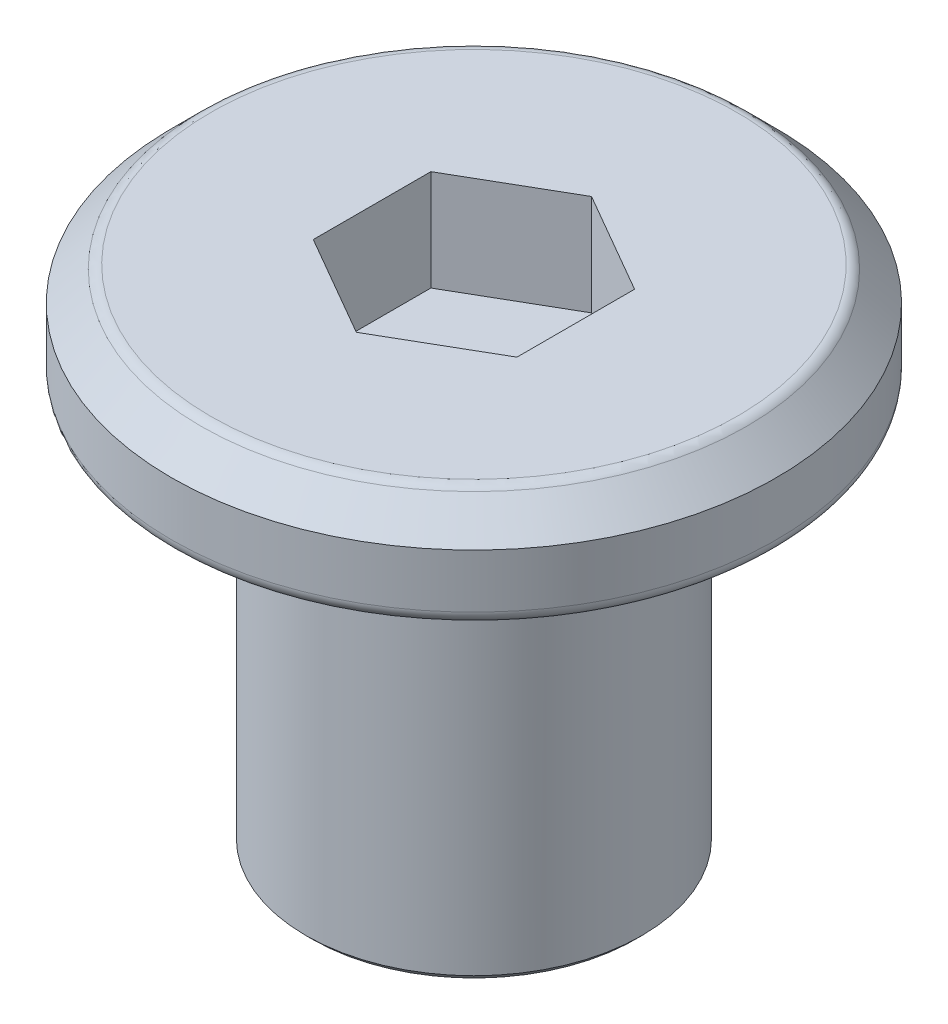
ISO-10303-21;
HEADER;
FILE_DESCRIPTION(('STEP AP214'),'2;1');
FILE_NAME('part.step','',(''),(''),'','','');
FILE_SCHEMA(('AUTOMOTIVE_DESIGN { 1 0 10303 214 1 1 1 1 }'));
ENDSEC;
DATA;
#1=APPLICATION_CONTEXT('core data for automotive mechanical design processes');
#2=APPLICATION_PROTOCOL_DEFINITION('international standard','automotive_design',2000,#1);
#3=PRODUCT_CONTEXT('',#1,'mechanical');
#4=PRODUCT('Part','Part','',(#3));
#5=PRODUCT_RELATED_PRODUCT_CATEGORY('part','',(#4));
#6=PRODUCT_DEFINITION_FORMATION('','',#4);
#7=PRODUCT_DEFINITION_CONTEXT('part definition',#1,'design');
#8=PRODUCT_DEFINITION('design','',#6,#7);
#9=PRODUCT_DEFINITION_SHAPE('','',#8);
#10=(LENGTH_UNIT() NAMED_UNIT(*) SI_UNIT(.MILLI.,.METRE.));
#11=(NAMED_UNIT(*) PLANE_ANGLE_UNIT() SI_UNIT($,.RADIAN.));
#12=(NAMED_UNIT(*) SI_UNIT($,.STERADIAN.) SOLID_ANGLE_UNIT());
#13=UNCERTAINTY_MEASURE_WITH_UNIT(LENGTH_MEASURE(1.E-05),#10,'distance_accuracy_value','');
#14=(GEOMETRIC_REPRESENTATION_CONTEXT(3) GLOBAL_UNCERTAINTY_ASSIGNED_CONTEXT((#13)) GLOBAL_UNIT_ASSIGNED_CONTEXT((#10,
#11,#12)) REPRESENTATION_CONTEXT('',''));
#15=CARTESIAN_POINT('',(0.,0.,0.));
#16=DIRECTION('',(0.,0.,1.));
#17=DIRECTION('',(1.,0.,0.));
#18=AXIS2_PLACEMENT_3D('',#15,#16,#17);
#19=CARTESIAN_POINT('',(0.,1.5,0.));
#20=DIRECTION('',(0.,-1.,0.));
#21=DIRECTION('',(0.,0.,-1.));
#22=AXIS2_PLACEMENT_3D('',#19,#20,#21);
#23=CYLINDRICAL_SURFACE('',#22,4.5);
#24=CARTESIAN_POINT('',(0.,0.2,0.));
#25=DIRECTION('',(0.,1.,0.));
#26=DIRECTION('',(0.,0.,1.));
#27=AXIS2_PLACEMENT_3D('',#24,#25,#26);
#28=CIRCLE('',#27,4.5);
#29=CARTESIAN_POINT('',(0.,0.2,4.5));
#30=VERTEX_POINT('',#29);
#31=EDGE_CURVE('E131',#30,#30,#28,.T.);
#32=ORIENTED_EDGE('',*,*,#31,.T.);
#33=EDGE_LOOP('',(#32));
#34=FACE_BOUND('',#33,.T.);
#35=CARTESIAN_POINT('',(0.,0.999999999999997,0.));
#36=DIRECTION('',(0.,1.,0.));
#37=DIRECTION('',(0.,0.,1.));
#38=AXIS2_PLACEMENT_3D('',#35,#36,#37);
#39=CIRCLE('',#38,4.5);
#40=CARTESIAN_POINT('',(0.,0.999999999999997,4.5));
#41=VERTEX_POINT('',#40);
#42=EDGE_CURVE('E117',#41,#41,#39,.F.);
#43=ORIENTED_EDGE('',*,*,#42,.T.);
#44=EDGE_LOOP('',(#43));
#45=FACE_BOUND('',#44,.T.);
#46=ADVANCED_FACE('F16',(#34,#45),#23,.T.);
#47=CARTESIAN_POINT('',(0.,1.5,0.));
#48=DIRECTION('',(0.,1.,0.));
#49=DIRECTION('',(0.,0.,1.));
#50=AXIS2_PLACEMENT_3D('',#47,#48,#49);
#51=PLANE('',#50);
#52=CARTESIAN_POINT('',(0.,1.5,0.));
#53=DIRECTION('',(0.,1.,0.));
#54=DIRECTION('',(0.,0.,1.));
#55=AXIS2_PLACEMENT_3D('',#52,#53,#54);
#56=CIRCLE('',#55,3.91715728752538);
#57=CARTESIAN_POINT('',(0.,1.5,3.91715728752538));
#58=VERTEX_POINT('',#57);
#59=EDGE_CURVE('E125',#58,#58,#56,.T.);
#60=ORIENTED_EDGE('',*,*,#59,.T.);
#61=EDGE_LOOP('',(#60));
#62=FACE_BOUND('',#61,.T.);
#63=DIRECTION('',(-0.866025403784438,0.,-0.5));
#64=VECTOR('',#63,1.);
#65=CARTESIAN_POINT('',(1.51554445662277,1.5,-0.875));
#66=LINE('',#65,#64);
#67=CARTESIAN_POINT('',(1.51554445662277,1.5,-0.875));
#68=VERTEX_POINT('',#67);
#69=CARTESIAN_POINT('',(0.,1.5,-1.75));
#70=VERTEX_POINT('',#69);
#71=EDGE_CURVE('E32',#68,#70,#66,.T.);
#72=ORIENTED_EDGE('',*,*,#71,.F.);
#73=DIRECTION('',(0.,0.,-1.));
#74=VECTOR('',#73,1.);
#75=CARTESIAN_POINT('',(1.51554445662277,1.5,0.875000000000001));
#76=LINE('',#75,#74);
#77=CARTESIAN_POINT('',(1.51554445662277,1.5,0.875000000000001));
#78=VERTEX_POINT('',#77);
#79=EDGE_CURVE('E113',#78,#68,#76,.T.);
#80=ORIENTED_EDGE('',*,*,#79,.F.);
#81=DIRECTION('',(0.866025403784439,0.,-0.5));
#82=VECTOR('',#81,1.);
#83=CARTESIAN_POINT('',(0.,1.5,1.75));
#84=LINE('',#83,#82);
#85=CARTESIAN_POINT('',(0.,1.5,1.75));
#86=VERTEX_POINT('',#85);
#87=EDGE_CURVE('E111',#86,#78,#84,.T.);
#88=ORIENTED_EDGE('',*,*,#87,.F.);
#89=DIRECTION('',(0.866025403784438,0.,0.5));
#90=VECTOR('',#89,1.);
#91=CARTESIAN_POINT('',(-1.51554445662277,1.5,0.874999999999999));
#92=LINE('',#91,#90);
#93=CARTESIAN_POINT('',(-1.51554445662277,1.5,0.874999999999999));
#94=VERTEX_POINT('',#93);
#95=EDGE_CURVE('E79',#94,#86,#92,.T.);
#96=ORIENTED_EDGE('',*,*,#95,.F.);
#97=DIRECTION('',(0.,0.,1.));
#98=VECTOR('',#97,1.);
#99=CARTESIAN_POINT('',(-1.51554445662277,1.5,-0.875));
#100=LINE('',#99,#98);
#101=CARTESIAN_POINT('',(-1.51554445662277,1.5,-0.875));
#102=VERTEX_POINT('',#101);
#103=EDGE_CURVE('E107',#102,#94,#100,.T.);
#104=ORIENTED_EDGE('',*,*,#103,.F.);
#105=DIRECTION('',(-0.866025403784439,0.,0.5));
#106=VECTOR('',#105,1.);
#107=CARTESIAN_POINT('',(0.,1.5,-1.75));
#108=LINE('',#107,#106);
#109=EDGE_CURVE('E104',#70,#102,#108,.T.);
#110=ORIENTED_EDGE('',*,*,#109,.F.);
#111=EDGE_LOOP('',(#72,#80,#88,#96,#104,#110));
#112=FACE_BOUND('',#111,.T.);
#113=ADVANCED_FACE('F158',(#62,#112),#51,.T.);
#114=CARTESIAN_POINT('',(0.,0.,0.));
#115=DIRECTION('',(0.,1.,0.));
#116=DIRECTION('',(0.,0.,1.));
#117=AXIS2_PLACEMENT_3D('',#114,#115,#116);
#118=PLANE('',#117);
#119=CARTESIAN_POINT('',(0.,0.,0.));
#120=DIRECTION('',(0.,1.,0.));
#121=DIRECTION('',(0.,0.,1.));
#122=AXIS2_PLACEMENT_3D('',#119,#120,#121);
#123=CIRCLE('',#122,2.75);
#124=CARTESIAN_POINT('',(0.,0.,2.75));
#125=VERTEX_POINT('',#124);
#126=EDGE_CURVE('E140',#125,#125,#123,.T.);
#127=ORIENTED_EDGE('',*,*,#126,.T.);
#128=EDGE_LOOP('',(#127));
#129=FACE_BOUND('',#128,.T.);
#130=CARTESIAN_POINT('',(0.,0.,0.));
#131=DIRECTION('',(0.,1.,0.));
#132=DIRECTION('',(0.,0.,1.));
#133=AXIS2_PLACEMENT_3D('',#130,#131,#132);
#134=CIRCLE('',#133,4.3);
#135=CARTESIAN_POINT('',(0.,0.,4.3));
#136=VERTEX_POINT('',#135);
#137=EDGE_CURVE('E134',#136,#136,#134,.F.);
#138=ORIENTED_EDGE('',*,*,#137,.T.);
#139=EDGE_LOOP('',(#138));
#140=FACE_BOUND('',#139,.T.);
#141=ADVANCED_FACE('F164',(#129,#140),#118,.F.);
#142=CARTESIAN_POINT('',(0.,1.5,0.));
#143=DIRECTION('',(0.,-1.,0.));
#144=DIRECTION('',(0.,0.,-1.));
#145=AXIS2_PLACEMENT_3D('',#142,#143,#144);
#146=CONICAL_SURFACE('',#145,4.,0.785398163397447);
#147=CARTESIAN_POINT('',(0.,1.44142135623731,0.));
#148=DIRECTION('',(0.,1.,0.));
#149=DIRECTION('',(0.,0.,1.));
#150=AXIS2_PLACEMENT_3D('',#147,#148,#149);
#151=CIRCLE('',#150,4.05857864376269);
#152=CARTESIAN_POINT('',(0.,1.44142135623731,4.05857864376269));
#153=VERTEX_POINT('',#152);
#154=EDGE_CURVE('E128',#153,#153,#151,.F.);
#155=ORIENTED_EDGE('',*,*,#154,.T.);
#156=EDGE_LOOP('',(#155));
#157=FACE_BOUND('',#156,.T.);
#158=ORIENTED_EDGE('',*,*,#42,.F.);
#159=EDGE_LOOP('',(#158));
#160=FACE_BOUND('',#159,.T.);
#161=ADVANCED_FACE('F170',(#157,#160),#146,.T.);
#162=CARTESIAN_POINT('',(1.51554445662277,0.,-0.875));
#163=DIRECTION('',(0.5,0.,-0.866025403784439));
#164=DIRECTION('',(-0.866025403784439,0.,-0.5));
#165=AXIS2_PLACEMENT_3D('',#162,#163,#164);
#166=PLANE('',#165);
#167=ORIENTED_EDGE('',*,*,#71,.T.);
#168=DIRECTION('',(0.,1.,0.));
#169=VECTOR('',#168,1.);
#170=CARTESIAN_POINT('',(0.,0.,-1.75));
#171=LINE('',#170,#169);
#172=CARTESIAN_POINT('',(0.,0.,-1.75));
#173=VERTEX_POINT('',#172);
#174=EDGE_CURVE('E63',#173,#70,#171,.T.);
#175=ORIENTED_EDGE('',*,*,#174,.F.);
#176=DIRECTION('',(-0.866025403784438,0.,-0.5));
#177=VECTOR('',#176,1.);
#178=CARTESIAN_POINT('',(1.51554445662277,0.,-0.875));
#179=LINE('',#178,#177);
#180=CARTESIAN_POINT('',(1.51554445662277,0.,-0.875));
#181=VERTEX_POINT('',#180);
#182=EDGE_CURVE('E115',#181,#173,#179,.T.);
#183=ORIENTED_EDGE('',*,*,#182,.F.);
#184=DIRECTION('',(0.,1.,0.));
#185=VECTOR('',#184,1.);
#186=CARTESIAN_POINT('',(1.51554445662277,0.,-0.875));
#187=LINE('',#186,#185);
#188=EDGE_CURVE('E40',#181,#68,#187,.T.);
#189=ORIENTED_EDGE('',*,*,#188,.T.);
#190=EDGE_LOOP('',(#167,#175,#183,#189));
#191=FACE_BOUND('',#190,.T.);
#192=ADVANCED_FACE('F173',(#191),#166,.F.);
#193=CARTESIAN_POINT('',(1.51554445662277,0.,0.875000000000001));
#194=DIRECTION('',(1.,0.,0.));
#195=DIRECTION('',(0.,0.,-1.));
#196=AXIS2_PLACEMENT_3D('',#193,#194,#195);
#197=PLANE('',#196);
#198=ORIENTED_EDGE('',*,*,#79,.T.);
#199=ORIENTED_EDGE('',*,*,#188,.F.);
#200=DIRECTION('',(0.,0.,-1.));
#201=VECTOR('',#200,1.);
#202=CARTESIAN_POINT('',(1.51554445662277,0.,0.875000000000001));
#203=LINE('',#202,#201);
#204=CARTESIAN_POINT('',(1.51554445662277,0.,0.875000000000001));
#205=VERTEX_POINT('',#204);
#206=EDGE_CURVE('E91',#205,#181,#203,.T.);
#207=ORIENTED_EDGE('',*,*,#206,.F.);
#208=DIRECTION('',(0.,1.,0.));
#209=VECTOR('',#208,1.);
#210=CARTESIAN_POINT('',(1.51554445662277,0.,0.875000000000001));
#211=LINE('',#210,#209);
#212=EDGE_CURVE('E83',#205,#78,#211,.T.);
#213=ORIENTED_EDGE('',*,*,#212,.T.);
#214=EDGE_LOOP('',(#198,#199,#207,#213));
#215=FACE_BOUND('',#214,.T.);
#216=ADVANCED_FACE('F207',(#215),#197,.F.);
#217=CARTESIAN_POINT('',(0.,0.,1.75));
#218=DIRECTION('',(0.5,0.,0.866025403784439));
#219=DIRECTION('',(0.866025403784439,0.,-0.5));
#220=AXIS2_PLACEMENT_3D('',#217,#218,#219);
#221=PLANE('',#220);
#222=ORIENTED_EDGE('',*,*,#87,.T.);
#223=ORIENTED_EDGE('',*,*,#212,.F.);
#224=DIRECTION('',(0.866025403784439,0.,-0.5));
#225=VECTOR('',#224,1.);
#226=CARTESIAN_POINT('',(0.,0.,1.75));
#227=LINE('',#226,#225);
#228=CARTESIAN_POINT('',(0.,0.,1.75));
#229=VERTEX_POINT('',#228);
#230=EDGE_CURVE('E87',#229,#205,#227,.T.);
#231=ORIENTED_EDGE('',*,*,#230,.F.);
#232=DIRECTION('',(0.,1.,0.));
#233=VECTOR('',#232,1.);
#234=CARTESIAN_POINT('',(0.,0.,1.75));
#235=LINE('',#234,#233);
#236=EDGE_CURVE('E72',#229,#86,#235,.T.);
#237=ORIENTED_EDGE('',*,*,#236,.T.);
#238=EDGE_LOOP('',(#222,#223,#231,#237));
#239=FACE_BOUND('',#238,.T.);
#240=ADVANCED_FACE('F88',(#239),#221,.F.);
#241=CARTESIAN_POINT('',(-1.51554445662277,0.,0.874999999999999));
#242=DIRECTION('',(-0.5,0.,0.866025403784438));
#243=DIRECTION('',(0.866025403784439,0.,0.5));
#244=AXIS2_PLACEMENT_3D('',#241,#242,#243);
#245=PLANE('',#244);
#246=ORIENTED_EDGE('',*,*,#95,.T.);
#247=ORIENTED_EDGE('',*,*,#236,.F.);
#248=DIRECTION('',(0.866025403784438,0.,0.5));
#249=VECTOR('',#248,1.);
#250=CARTESIAN_POINT('',(-1.51554445662277,0.,0.874999999999999));
#251=LINE('',#250,#249);
#252=CARTESIAN_POINT('',(-1.51554445662277,0.,0.874999999999999));
#253=VERTEX_POINT('',#252);
#254=EDGE_CURVE('E76',#253,#229,#251,.T.);
#255=ORIENTED_EDGE('',*,*,#254,.F.);
#256=DIRECTION('',(0.,1.,0.));
#257=VECTOR('',#256,1.);
#258=CARTESIAN_POINT('',(-1.51554445662277,0.,0.874999999999999));
#259=LINE('',#258,#257);
#260=EDGE_CURVE('E84',#253,#94,#259,.T.);
#261=ORIENTED_EDGE('',*,*,#260,.T.);
#262=EDGE_LOOP('',(#246,#247,#255,#261));
#263=FACE_BOUND('',#262,.T.);
#264=ADVANCED_FACE('F74',(#263),#245,.F.);
#265=CARTESIAN_POINT('',(-1.51554445662277,0.,-0.875));
#266=DIRECTION('',(-1.,0.,0.));
#267=DIRECTION('',(0.,0.,1.));
#268=AXIS2_PLACEMENT_3D('',#265,#266,#267);
#269=PLANE('',#268);
#270=ORIENTED_EDGE('',*,*,#103,.T.);
#271=ORIENTED_EDGE('',*,*,#260,.F.);
#272=DIRECTION('',(0.,0.,1.));
#273=VECTOR('',#272,1.);
#274=CARTESIAN_POINT('',(-1.51554445662277,0.,-0.875));
#275=LINE('',#274,#273);
#276=CARTESIAN_POINT('',(-1.51554445662277,0.,-0.875000000000001));
#277=VERTEX_POINT('',#276);
#278=EDGE_CURVE('E96',#277,#253,#275,.T.);
#279=ORIENTED_EDGE('',*,*,#278,.F.);
#280=DIRECTION('',(0.,1.,0.));
#281=VECTOR('',#280,1.);
#282=CARTESIAN_POINT('',(-1.51554445662277,0.,-0.875));
#283=LINE('',#282,#281);
#284=EDGE_CURVE('E120',#277,#102,#283,.T.);
#285=ORIENTED_EDGE('',*,*,#284,.T.);
#286=EDGE_LOOP('',(#270,#271,#279,#285));
#287=FACE_BOUND('',#286,.T.);
#288=ADVANCED_FACE('F214',(#287),#269,.F.);
#289=CARTESIAN_POINT('',(0.,0.,-1.75));
#290=DIRECTION('',(-0.5,0.,-0.866025403784439));
#291=DIRECTION('',(-0.866025403784439,0.,0.5));
#292=AXIS2_PLACEMENT_3D('',#289,#290,#291);
#293=PLANE('',#292);
#294=ORIENTED_EDGE('',*,*,#109,.T.);
#295=ORIENTED_EDGE('',*,*,#284,.F.);
#296=DIRECTION('',(-0.866025403784439,0.,0.5));
#297=VECTOR('',#296,1.);
#298=CARTESIAN_POINT('',(0.,0.,-1.75));
#299=LINE('',#298,#297);
#300=EDGE_CURVE('E98',#173,#277,#299,.T.);
#301=ORIENTED_EDGE('',*,*,#300,.F.);
#302=ORIENTED_EDGE('',*,*,#174,.T.);
#303=EDGE_LOOP('',(#294,#295,#301,#302));
#304=FACE_BOUND('',#303,.T.);
#305=ADVANCED_FACE('F204',(#304),#293,.F.);
#306=CARTESIAN_POINT('',(0.,0.,0.));
#307=DIRECTION('',(0.,-1.,0.));
#308=DIRECTION('',(0.,0.,-1.));
#309=AXIS2_PLACEMENT_3D('',#306,#307,#308);
#310=PLANE('',#309);
#311=ORIENTED_EDGE('',*,*,#206,.T.);
#312=ORIENTED_EDGE('',*,*,#182,.T.);
#313=ORIENTED_EDGE('',*,*,#300,.T.);
#314=ORIENTED_EDGE('',*,*,#278,.T.);
#315=ORIENTED_EDGE('',*,*,#254,.T.);
#316=ORIENTED_EDGE('',*,*,#230,.T.);
#317=EDGE_LOOP('',(#311,#312,#313,#314,#315,#316));
#318=FACE_BOUND('',#317,.T.);
#319=ADVANCED_FACE('F93',(#318),#310,.F.);
#320=CARTESIAN_POINT('',(0.,-6.,0.));
#321=DIRECTION('',(0.,1.,0.));
#322=DIRECTION('',(0.,0.,1.));
#323=AXIS2_PLACEMENT_3D('',#320,#321,#322);
#324=CYLINDRICAL_SURFACE('',#323,2.5);
#325=CARTESIAN_POINT('',(0.,-5.9,0.));
#326=DIRECTION('',(0.,-1.,0.));
#327=DIRECTION('',(0.,0.,-1.));
#328=AXIS2_PLACEMENT_3D('',#325,#326,#327);
#329=CIRCLE('',#328,2.5);
#330=CARTESIAN_POINT('',(0.,-5.9,-2.5));
#331=VERTEX_POINT('',#330);
#332=EDGE_CURVE('E10',#331,#331,#329,.F.);
#333=ORIENTED_EDGE('',*,*,#332,.T.);
#334=EDGE_LOOP('',(#333));
#335=FACE_BOUND('',#334,.T.);
#336=CARTESIAN_POINT('',(0.,-0.25,0.));
#337=DIRECTION('',(0.,1.,0.));
#338=DIRECTION('',(0.,0.,1.));
#339=AXIS2_PLACEMENT_3D('',#336,#337,#338);
#340=CIRCLE('',#339,2.5);
#341=CARTESIAN_POINT('',(0.,-0.25,2.5));
#342=VERTEX_POINT('',#341);
#343=EDGE_CURVE('E137',#342,#342,#340,.F.);
#344=ORIENTED_EDGE('',*,*,#343,.T.);
#345=EDGE_LOOP('',(#344));
#346=FACE_BOUND('',#345,.T.);
#347=ADVANCED_FACE('F195',(#335,#346),#324,.T.);
#348=CARTESIAN_POINT('',(0.,-6.,0.));
#349=DIRECTION('',(0.,-1.,0.));
#350=DIRECTION('',(0.,0.,-1.));
#351=AXIS2_PLACEMENT_3D('',#348,#349,#350);
#352=PLANE('',#351);
#353=CARTESIAN_POINT('',(0.,-6.,0.));
#354=DIRECTION('',(0.,-1.,0.));
#355=DIRECTION('',(0.,0.,-1.));
#356=AXIS2_PLACEMENT_3D('',#353,#354,#355);
#357=CIRCLE('',#356,2.4);
#358=CARTESIAN_POINT('',(0.,-6.,-2.4));
#359=VERTEX_POINT('',#358);
#360=EDGE_CURVE('E25',#359,#359,#357,.T.);
#361=ORIENTED_EDGE('',*,*,#360,.T.);
#362=EDGE_LOOP('',(#361));
#363=FACE_BOUND('',#362,.T.);
#364=ADVANCED_FACE('F145',(#363),#352,.T.);
#365=CARTESIAN_POINT('',(0.,1.3,0.));
#366=DIRECTION('',(0.,1.,0.));
#367=DIRECTION('',(0.,0.,1.));
#368=AXIS2_PLACEMENT_3D('',#365,#366,#367);
#369=TOROIDAL_SURFACE('',#368,3.91715728752538,0.2);
#370=ORIENTED_EDGE('',*,*,#154,.F.);
#371=EDGE_LOOP('',(#370));
#372=FACE_BOUND('',#371,.T.);
#373=ORIENTED_EDGE('',*,*,#59,.F.);
#374=EDGE_LOOP('',(#373));
#375=FACE_BOUND('',#374,.T.);
#376=ADVANCED_FACE('F175',(#372,#375),#369,.T.);
#377=CARTESIAN_POINT('',(0.,0.2,0.));
#378=DIRECTION('',(0.,1.,0.));
#379=DIRECTION('',(0.,0.,1.));
#380=AXIS2_PLACEMENT_3D('',#377,#378,#379);
#381=TOROIDAL_SURFACE('',#380,4.3,0.2);
#382=ORIENTED_EDGE('',*,*,#137,.F.);
#383=EDGE_LOOP('',(#382));
#384=FACE_BOUND('',#383,.T.);
#385=ORIENTED_EDGE('',*,*,#31,.F.);
#386=EDGE_LOOP('',(#385));
#387=FACE_BOUND('',#386,.T.);
#388=ADVANCED_FACE('F154',(#384,#387),#381,.T.);
#389=CARTESIAN_POINT('',(0.,-0.25,0.));
#390=DIRECTION('',(0.,1.,0.));
#391=DIRECTION('',(0.,0.,1.));
#392=AXIS2_PLACEMENT_3D('',#389,#390,#391);
#393=TOROIDAL_SURFACE('',#392,2.75,0.25);
#394=ORIENTED_EDGE('',*,*,#126,.F.);
#395=EDGE_LOOP('',(#394));
#396=FACE_BOUND('',#395,.T.);
#397=ORIENTED_EDGE('',*,*,#343,.F.);
#398=EDGE_LOOP('',(#397));
#399=FACE_BOUND('',#398,.T.);
#400=ADVANCED_FACE('F148',(#396,#399),#393,.F.);
#401=CARTESIAN_POINT('',(0.,-6.,0.));
#402=DIRECTION('',(0.,1.,0.));
#403=DIRECTION('',(0.,0.,1.));
#404=AXIS2_PLACEMENT_3D('',#401,#402,#403);
#405=CONICAL_SURFACE('',#404,2.4,0.785398163397455);
#406=ORIENTED_EDGE('',*,*,#332,.F.);
#407=EDGE_LOOP('',(#406));
#408=FACE_BOUND('',#407,.T.);
#409=ORIENTED_EDGE('',*,*,#360,.F.);
#410=EDGE_LOOP('',(#409));
#411=FACE_BOUND('',#410,.T.);
#412=ADVANCED_FACE('F19',(#408,#411),#405,.T.);
#413=CLOSED_SHELL('',(#46,#113,#141,#161,#192,#216,#240,#264,#288,#305,#319,#347,#364,#376,#388,
#400,#412));
#414=MANIFOLD_SOLID_BREP('B1',#413);
#415=ADVANCED_BREP_SHAPE_REPRESENTATION('',(#18,#414),#14);
#416=SHAPE_DEFINITION_REPRESENTATION(#9,#415);
ENDSEC;
END-ISO-10303-21;
